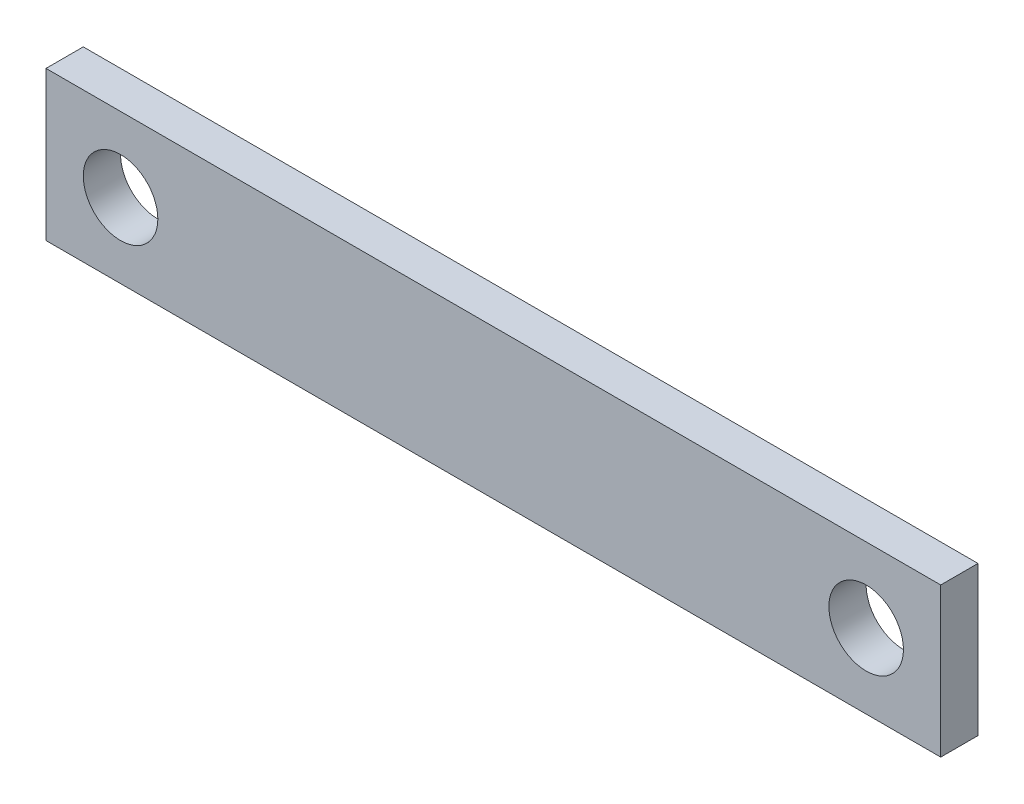
ISO-10303-21;
HEADER;
FILE_DESCRIPTION(('STEP AP214'),'2;1');
FILE_NAME('part.step','',(''),(''),'','','');
FILE_SCHEMA(('AUTOMOTIVE_DESIGN { 1 0 10303 214 1 1 1 1 }'));
ENDSEC;
DATA;
#1=APPLICATION_CONTEXT('core data for automotive mechanical design processes');
#2=APPLICATION_PROTOCOL_DEFINITION('international standard','automotive_design',2000,#1);
#3=PRODUCT_CONTEXT('',#1,'mechanical');
#4=PRODUCT('Part','Part','',(#3));
#5=PRODUCT_RELATED_PRODUCT_CATEGORY('part','',(#4));
#6=PRODUCT_DEFINITION_FORMATION('','',#4);
#7=PRODUCT_DEFINITION_CONTEXT('part definition',#1,'design');
#8=PRODUCT_DEFINITION('design','',#6,#7);
#9=PRODUCT_DEFINITION_SHAPE('','',#8);
#10=(LENGTH_UNIT() NAMED_UNIT(*) SI_UNIT(.MILLI.,.METRE.));
#11=(NAMED_UNIT(*) PLANE_ANGLE_UNIT() SI_UNIT($,.RADIAN.));
#12=(NAMED_UNIT(*) SI_UNIT($,.STERADIAN.) SOLID_ANGLE_UNIT());
#13=UNCERTAINTY_MEASURE_WITH_UNIT(LENGTH_MEASURE(1.E-05),#10,'distance_accuracy_value','');
#14=(GEOMETRIC_REPRESENTATION_CONTEXT(3) GLOBAL_UNCERTAINTY_ASSIGNED_CONTEXT((#13)) GLOBAL_UNIT_ASSIGNED_CONTEXT((#10,
#11,#12)) REPRESENTATION_CONTEXT('',''));
#15=CARTESIAN_POINT('',(0.,0.,0.));
#16=DIRECTION('',(0.,0.,1.));
#17=DIRECTION('',(1.,0.,0.));
#18=AXIS2_PLACEMENT_3D('',#15,#16,#17);
#19=CARTESIAN_POINT('',(0.,0.,3.175));
#20=DIRECTION('',(0.,0.,-1.));
#21=DIRECTION('',(-1.,0.,0.));
#22=AXIS2_PLACEMENT_3D('',#19,#20,#21);
#23=PLANE('',#22);
#24=DIRECTION('',(1.,0.,0.));
#25=VECTOR('',#24,1.);
#26=CARTESIAN_POINT('',(76.2,0.,3.175));
#27=LINE('',#26,#25);
#28=CARTESIAN_POINT('',(0.,0.,3.175));
#29=VERTEX_POINT('',#28);
#30=CARTESIAN_POINT('',(76.2,0.,3.175));
#31=VERTEX_POINT('',#30);
#32=EDGE_CURVE('E84',#29,#31,#27,.T.);
#33=ORIENTED_EDGE('',*,*,#32,.T.);
#34=DIRECTION('',(0.,1.,0.));
#35=VECTOR('',#34,1.);
#36=CARTESIAN_POINT('',(76.2,12.7,3.175));
#37=LINE('',#36,#35);
#38=CARTESIAN_POINT('',(76.2,12.7,3.175));
#39=VERTEX_POINT('',#38);
#40=EDGE_CURVE('E79',#31,#39,#37,.T.);
#41=ORIENTED_EDGE('',*,*,#40,.T.);
#42=DIRECTION('',(-1.,0.,0.));
#43=VECTOR('',#42,1.);
#44=CARTESIAN_POINT('',(0.,12.7,3.175));
#45=LINE('',#44,#43);
#46=CARTESIAN_POINT('',(0.,12.7,3.175));
#47=VERTEX_POINT('',#46);
#48=EDGE_CURVE('E82',#39,#47,#45,.T.);
#49=ORIENTED_EDGE('',*,*,#48,.T.);
#50=DIRECTION('',(0.,-1.,0.));
#51=VECTOR('',#50,1.);
#52=CARTESIAN_POINT('',(0.,0.,3.175));
#53=LINE('',#52,#51);
#54=EDGE_CURVE('E49',#47,#29,#53,.T.);
#55=ORIENTED_EDGE('',*,*,#54,.T.);
#56=EDGE_LOOP('',(#33,#41,#49,#55));
#57=FACE_BOUND('',#56,.T.);
#58=CARTESIAN_POINT('',(6.35,6.35,3.175));
#59=DIRECTION('',(0.,0.,1.));
#60=DIRECTION('',(1.,0.,0.));
#61=AXIS2_PLACEMENT_3D('',#58,#59,#60);
#62=CIRCLE('',#61,3.175);
#63=CARTESIAN_POINT('',(9.525,6.35,3.175));
#64=VERTEX_POINT('',#63);
#65=EDGE_CURVE('E99',#64,#64,#62,.T.);
#66=ORIENTED_EDGE('',*,*,#65,.F.);
#67=EDGE_LOOP('',(#66));
#68=FACE_BOUND('',#67,.T.);
#69=CARTESIAN_POINT('',(69.85,6.35000000000001,3.175));
#70=DIRECTION('',(0.,0.,1.));
#71=DIRECTION('',(1.,0.,0.));
#72=AXIS2_PLACEMENT_3D('',#69,#70,#71);
#73=CIRCLE('',#72,3.175);
#74=CARTESIAN_POINT('',(73.025,6.35000000000001,3.175));
#75=VERTEX_POINT('',#74);
#76=EDGE_CURVE('E114',#75,#75,#73,.T.);
#77=ORIENTED_EDGE('',*,*,#76,.F.);
#78=EDGE_LOOP('',(#77));
#79=FACE_BOUND('',#78,.T.);
#80=ADVANCED_FACE('F32',(#57,#68,#79),#23,.F.);
#81=CARTESIAN_POINT('',(0.,0.,0.));
#82=DIRECTION('',(0.,0.,-1.));
#83=DIRECTION('',(-1.,0.,0.));
#84=AXIS2_PLACEMENT_3D('',#81,#82,#83);
#85=PLANE('',#84);
#86=CARTESIAN_POINT('',(6.35,6.35,0.));
#87=DIRECTION('',(0.,0.,1.));
#88=DIRECTION('',(1.,0.,0.));
#89=AXIS2_PLACEMENT_3D('',#86,#87,#88);
#90=CIRCLE('',#89,3.175);
#91=CARTESIAN_POINT('',(9.525,6.35,0.));
#92=VERTEX_POINT('',#91);
#93=EDGE_CURVE('E111',#92,#92,#90,.T.);
#94=ORIENTED_EDGE('',*,*,#93,.T.);
#95=EDGE_LOOP('',(#94));
#96=FACE_BOUND('',#95,.T.);
#97=DIRECTION('',(1.,0.,0.));
#98=VECTOR('',#97,1.);
#99=CARTESIAN_POINT('',(76.2,0.,0.));
#100=LINE('',#99,#98);
#101=CARTESIAN_POINT('',(0.,0.,0.));
#102=VERTEX_POINT('',#101);
#103=CARTESIAN_POINT('',(76.2,0.,0.));
#104=VERTEX_POINT('',#103);
#105=EDGE_CURVE('E96',#102,#104,#100,.T.);
#106=ORIENTED_EDGE('',*,*,#105,.F.);
#107=DIRECTION('',(0.,-1.,0.));
#108=VECTOR('',#107,1.);
#109=CARTESIAN_POINT('',(0.,0.,0.));
#110=LINE('',#109,#108);
#111=CARTESIAN_POINT('',(0.,12.7,0.));
#112=VERTEX_POINT('',#111);
#113=EDGE_CURVE('E72',#112,#102,#110,.T.);
#114=ORIENTED_EDGE('',*,*,#113,.F.);
#115=DIRECTION('',(-1.,0.,0.));
#116=VECTOR('',#115,1.);
#117=CARTESIAN_POINT('',(0.,12.7,0.));
#118=LINE('',#117,#116);
#119=CARTESIAN_POINT('',(76.2,12.7,0.));
#120=VERTEX_POINT('',#119);
#121=EDGE_CURVE('E66',#120,#112,#118,.T.);
#122=ORIENTED_EDGE('',*,*,#121,.F.);
#123=DIRECTION('',(0.,1.,0.));
#124=VECTOR('',#123,1.);
#125=CARTESIAN_POINT('',(76.2,12.7,0.));
#126=LINE('',#125,#124);
#127=EDGE_CURVE('E88',#104,#120,#126,.T.);
#128=ORIENTED_EDGE('',*,*,#127,.F.);
#129=EDGE_LOOP('',(#106,#114,#122,#128));
#130=FACE_BOUND('',#129,.T.);
#131=CARTESIAN_POINT('',(69.85,6.35000000000001,0.));
#132=DIRECTION('',(0.,0.,1.));
#133=DIRECTION('',(1.,0.,0.));
#134=AXIS2_PLACEMENT_3D('',#131,#132,#133);
#135=CIRCLE('',#134,3.175);
#136=CARTESIAN_POINT('',(73.025,6.35000000000001,0.));
#137=VERTEX_POINT('',#136);
#138=EDGE_CURVE('E117',#137,#137,#135,.T.);
#139=ORIENTED_EDGE('',*,*,#138,.T.);
#140=EDGE_LOOP('',(#139));
#141=FACE_BOUND('',#140,.T.);
#142=ADVANCED_FACE('F107',(#96,#130,#141),#85,.T.);
#143=CARTESIAN_POINT('',(76.2,0.,3.175));
#144=DIRECTION('',(0.,1.,0.));
#145=DIRECTION('',(-1.,0.,0.));
#146=AXIS2_PLACEMENT_3D('',#143,#144,#145);
#147=PLANE('',#146);
#148=ORIENTED_EDGE('',*,*,#105,.T.);
#149=DIRECTION('',(0.,0.,-1.));
#150=VECTOR('',#149,1.);
#151=CARTESIAN_POINT('',(76.2,0.,3.175));
#152=LINE('',#151,#150);
#153=EDGE_CURVE('E11',#31,#104,#152,.T.);
#154=ORIENTED_EDGE('',*,*,#153,.F.);
#155=ORIENTED_EDGE('',*,*,#32,.F.);
#156=DIRECTION('',(0.,0.,-1.));
#157=VECTOR('',#156,1.);
#158=CARTESIAN_POINT('',(0.,0.,3.175));
#159=LINE('',#158,#157);
#160=EDGE_CURVE('E92',#29,#102,#159,.T.);
#161=ORIENTED_EDGE('',*,*,#160,.T.);
#162=EDGE_LOOP('',(#148,#154,#155,#161));
#163=FACE_BOUND('',#162,.T.);
#164=ADVANCED_FACE('F34',(#163),#147,.F.);
#165=CARTESIAN_POINT('',(76.2,12.7,3.175));
#166=DIRECTION('',(-1.,0.,0.));
#167=DIRECTION('',(0.,0.,1.));
#168=AXIS2_PLACEMENT_3D('',#165,#166,#167);
#169=PLANE('',#168);
#170=ORIENTED_EDGE('',*,*,#127,.T.);
#171=DIRECTION('',(0.,0.,-1.));
#172=VECTOR('',#171,1.);
#173=CARTESIAN_POINT('',(76.2,12.7,3.175));
#174=LINE('',#173,#172);
#175=EDGE_CURVE('E41',#39,#120,#174,.T.);
#176=ORIENTED_EDGE('',*,*,#175,.F.);
#177=ORIENTED_EDGE('',*,*,#40,.F.);
#178=ORIENTED_EDGE('',*,*,#153,.T.);
#179=EDGE_LOOP('',(#170,#176,#177,#178));
#180=FACE_BOUND('',#179,.T.);
#181=ADVANCED_FACE('F87',(#180),#169,.F.);
#182=CARTESIAN_POINT('',(0.,12.7,3.175));
#183=DIRECTION('',(0.,-1.,0.));
#184=DIRECTION('',(1.,0.,0.));
#185=AXIS2_PLACEMENT_3D('',#182,#183,#184);
#186=PLANE('',#185);
#187=ORIENTED_EDGE('',*,*,#121,.T.);
#188=DIRECTION('',(0.,0.,-1.));
#189=VECTOR('',#188,1.);
#190=CARTESIAN_POINT('',(0.,12.7,3.175));
#191=LINE('',#190,#189);
#192=EDGE_CURVE('E89',#47,#112,#191,.T.);
#193=ORIENTED_EDGE('',*,*,#192,.F.);
#194=ORIENTED_EDGE('',*,*,#48,.F.);
#195=ORIENTED_EDGE('',*,*,#175,.T.);
#196=EDGE_LOOP('',(#187,#193,#194,#195));
#197=FACE_BOUND('',#196,.T.);
#198=ADVANCED_FACE('F90',(#197),#186,.F.);
#199=CARTESIAN_POINT('',(0.,0.,3.175));
#200=DIRECTION('',(1.,0.,0.));
#201=DIRECTION('',(0.,0.,-1.));
#202=AXIS2_PLACEMENT_3D('',#199,#200,#201);
#203=PLANE('',#202);
#204=ORIENTED_EDGE('',*,*,#113,.T.);
#205=ORIENTED_EDGE('',*,*,#160,.F.);
#206=ORIENTED_EDGE('',*,*,#54,.F.);
#207=ORIENTED_EDGE('',*,*,#192,.T.);
#208=EDGE_LOOP('',(#204,#205,#206,#207));
#209=FACE_BOUND('',#208,.T.);
#210=ADVANCED_FACE('F104',(#209),#203,.F.);
#211=CARTESIAN_POINT('',(6.35,6.35,3.175));
#212=DIRECTION('',(0.,0.,-1.));
#213=DIRECTION('',(-1.,0.,0.));
#214=AXIS2_PLACEMENT_3D('',#211,#212,#213);
#215=CYLINDRICAL_SURFACE('',#214,3.175);
#216=ORIENTED_EDGE('',*,*,#65,.T.);
#217=EDGE_LOOP('',(#216));
#218=FACE_BOUND('',#217,.T.);
#219=ORIENTED_EDGE('',*,*,#93,.F.);
#220=EDGE_LOOP('',(#219));
#221=FACE_BOUND('',#220,.T.);
#222=ADVANCED_FACE('F134',(#218,#221),#215,.F.);
#223=CARTESIAN_POINT('',(69.85,6.35000000000001,3.175));
#224=DIRECTION('',(0.,0.,-1.));
#225=DIRECTION('',(-1.,0.,0.));
#226=AXIS2_PLACEMENT_3D('',#223,#224,#225);
#227=CYLINDRICAL_SURFACE('',#226,3.175);
#228=ORIENTED_EDGE('',*,*,#76,.T.);
#229=EDGE_LOOP('',(#228));
#230=FACE_BOUND('',#229,.T.);
#231=ORIENTED_EDGE('',*,*,#138,.F.);
#232=EDGE_LOOP('',(#231));
#233=FACE_BOUND('',#232,.T.);
#234=ADVANCED_FACE('F123',(#230,#233),#227,.F.);
#235=CLOSED_SHELL('',(#80,#142,#164,#181,#198,#210,#222,#234));
#236=MANIFOLD_SOLID_BREP('B2',#235);
#237=ADVANCED_BREP_SHAPE_REPRESENTATION('',(#18,#236),#14);
#238=SHAPE_DEFINITION_REPRESENTATION(#9,#237);
ENDSEC;
END-ISO-10303-21;
